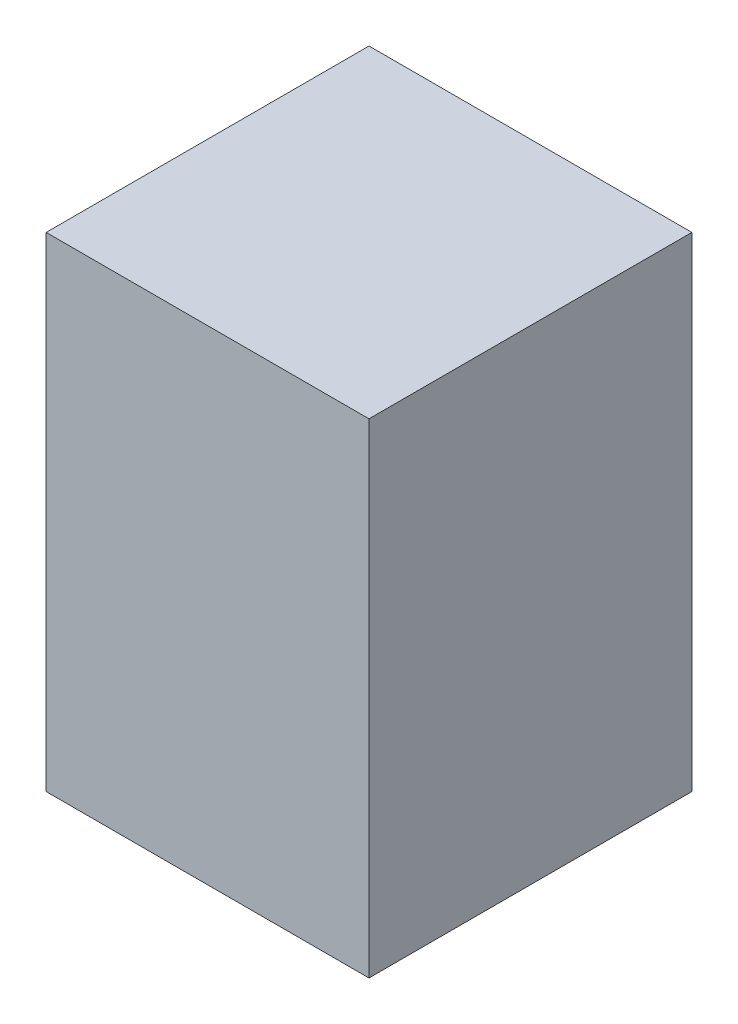
ISO-10303-21;
HEADER;
FILE_DESCRIPTION(('STEP AP214'),'2;1');
FILE_NAME('part.step','',(''),(''),'','','');
FILE_SCHEMA(('AUTOMOTIVE_DESIGN { 1 0 10303 214 1 1 1 1 }'));
ENDSEC;
DATA;
#1=APPLICATION_CONTEXT('core data for automotive mechanical design processes');
#2=APPLICATION_PROTOCOL_DEFINITION('international standard','automotive_design',2000,#1);
#3=PRODUCT_CONTEXT('',#1,'mechanical');
#4=PRODUCT('Part','Part','',(#3));
#5=PRODUCT_RELATED_PRODUCT_CATEGORY('part','',(#4));
#6=PRODUCT_DEFINITION_FORMATION('','',#4);
#7=PRODUCT_DEFINITION_CONTEXT('part definition',#1,'design');
#8=PRODUCT_DEFINITION('design','',#6,#7);
#9=PRODUCT_DEFINITION_SHAPE('','',#8);
#10=(LENGTH_UNIT() NAMED_UNIT(*) SI_UNIT(.MILLI.,.METRE.));
#11=(NAMED_UNIT(*) PLANE_ANGLE_UNIT() SI_UNIT($,.RADIAN.));
#12=(NAMED_UNIT(*) SI_UNIT($,.STERADIAN.) SOLID_ANGLE_UNIT());
#13=UNCERTAINTY_MEASURE_WITH_UNIT(LENGTH_MEASURE(1.E-05),#10,'distance_accuracy_value','');
#14=(GEOMETRIC_REPRESENTATION_CONTEXT(3) GLOBAL_UNCERTAINTY_ASSIGNED_CONTEXT((#13)) GLOBAL_UNIT_ASSIGNED_CONTEXT((#10,
#11,#12)) REPRESENTATION_CONTEXT('',''));
#15=CARTESIAN_POINT('',(0.,0.,0.));
#16=DIRECTION('',(0.,0.,1.));
#17=DIRECTION('',(1.,0.,0.));
#18=AXIS2_PLACEMENT_3D('',#15,#16,#17);
#19=CARTESIAN_POINT('',(-0.09999726000001,0.1499997,0.));
#20=DIRECTION('',(1.,0.,0.));
#21=DIRECTION('',(0.,0.,-1.));
#22=AXIS2_PLACEMENT_3D('',#19,#20,#21);
#23=PLANE('',#22);
#24=DIRECTION('',(0.,0.,1.));
#25=VECTOR('',#24,1.);
#26=CARTESIAN_POINT('',(-0.09999726000001,-0.1499997,0.));
#27=LINE('',#26,#25);
#28=CARTESIAN_POINT('',(-0.09999726000001,-0.1499997,0.));
#29=VERTEX_POINT('',#28);
#30=CARTESIAN_POINT('',(-0.09999726000001,-0.1499997,0.20000214));
#31=VERTEX_POINT('',#30);
#32=EDGE_CURVE('E20',#29,#31,#27,.T.);
#33=ORIENTED_EDGE('',*,*,#32,.T.);
#34=DIRECTION('',(0.,1.,0.));
#35=VECTOR('',#34,1.);
#36=CARTESIAN_POINT('',(-0.09999726000001,-0.1499997,0.20000214));
#37=LINE('',#36,#35);
#38=CARTESIAN_POINT('',(-0.09999726000001,0.1499997,0.20000214));
#39=VERTEX_POINT('',#38);
#40=EDGE_CURVE('E55',#31,#39,#37,.T.);
#41=ORIENTED_EDGE('',*,*,#40,.T.);
#42=DIRECTION('',(0.,0.,-1.));
#43=VECTOR('',#42,1.);
#44=CARTESIAN_POINT('',(-0.09999726000001,0.1499997,0.));
#45=LINE('',#44,#43);
#46=CARTESIAN_POINT('',(-0.09999726000001,0.1499997,0.));
#47=VERTEX_POINT('',#46);
#48=EDGE_CURVE('E76',#39,#47,#45,.T.);
#49=ORIENTED_EDGE('',*,*,#48,.T.);
#50=DIRECTION('',(0.,1.,0.));
#51=VECTOR('',#50,1.);
#52=CARTESIAN_POINT('',(-0.09999726000001,-0.1499997,0.));
#53=LINE('',#52,#51);
#54=EDGE_CURVE('E58',#29,#47,#53,.T.);
#55=ORIENTED_EDGE('',*,*,#54,.F.);
#56=EDGE_LOOP('',(#33,#41,#49,#55));
#57=FACE_BOUND('',#56,.T.);
#58=ADVANCED_FACE('F17',(#57),#23,.F.);
#59=CARTESIAN_POINT('',(-0.09999726000001,-0.1499997,0.));
#60=DIRECTION('',(0.,1.,0.));
#61=DIRECTION('',(0.,0.,1.));
#62=AXIS2_PLACEMENT_3D('',#59,#60,#61);
#63=PLANE('',#62);
#64=DIRECTION('',(0.,0.,1.));
#65=VECTOR('',#64,1.);
#66=CARTESIAN_POINT('',(0.09999979999999,-0.1499997,0.));
#67=LINE('',#66,#65);
#68=CARTESIAN_POINT('',(0.09999979999999,-0.1499997,0.));
#69=VERTEX_POINT('',#68);
#70=CARTESIAN_POINT('',(0.09999979999999,-0.1499997,0.20000214));
#71=VERTEX_POINT('',#70);
#72=EDGE_CURVE('E73',#69,#71,#67,.T.);
#73=ORIENTED_EDGE('',*,*,#72,.T.);
#74=DIRECTION('',(-1.,0.,0.));
#75=VECTOR('',#74,1.);
#76=CARTESIAN_POINT('',(0.09999979999999,-0.1499997,0.20000214));
#77=LINE('',#76,#75);
#78=EDGE_CURVE('E63',#71,#31,#77,.T.);
#79=ORIENTED_EDGE('',*,*,#78,.T.);
#80=ORIENTED_EDGE('',*,*,#32,.F.);
#81=DIRECTION('',(-1.,0.,0.));
#82=VECTOR('',#81,1.);
#83=CARTESIAN_POINT('',(0.09999979999999,-0.1499997,0.));
#84=LINE('',#83,#82);
#85=EDGE_CURVE('E78',#69,#29,#84,.T.);
#86=ORIENTED_EDGE('',*,*,#85,.F.);
#87=EDGE_LOOP('',(#73,#79,#80,#86));
#88=FACE_BOUND('',#87,.T.);
#89=ADVANCED_FACE('F72',(#88),#63,.F.);
#90=CARTESIAN_POINT('',(0.09999979999999,-0.1499997,0.20000214));
#91=DIRECTION('',(0.,0.,-1.));
#92=DIRECTION('',(-1.,0.,0.));
#93=AXIS2_PLACEMENT_3D('',#90,#91,#92);
#94=PLANE('',#93);
#95=DIRECTION('',(1.,0.,0.));
#96=VECTOR('',#95,1.);
#97=CARTESIAN_POINT('',(0.09999979999999,0.1499997,0.20000214));
#98=LINE('',#97,#96);
#99=CARTESIAN_POINT('',(0.09999979999999,0.1499997,0.20000214));
#100=VERTEX_POINT('',#99);
#101=EDGE_CURVE('E69',#100,#39,#98,.F.);
#102=ORIENTED_EDGE('',*,*,#101,.T.);
#103=ORIENTED_EDGE('',*,*,#40,.F.);
#104=ORIENTED_EDGE('',*,*,#78,.F.);
#105=DIRECTION('',(0.,1.,0.));
#106=VECTOR('',#105,1.);
#107=CARTESIAN_POINT('',(0.09999979999999,-0.1499997,0.20000214));
#108=LINE('',#107,#106);
#109=EDGE_CURVE('E83',#71,#100,#108,.T.);
#110=ORIENTED_EDGE('',*,*,#109,.T.);
#111=EDGE_LOOP('',(#102,#103,#104,#110));
#112=FACE_BOUND('',#111,.T.);
#113=ADVANCED_FACE('F66',(#112),#94,.F.);
#114=CARTESIAN_POINT('',(0.09999979999999,0.1499997,0.));
#115=DIRECTION('',(0.,-1.,0.));
#116=DIRECTION('',(0.,0.,-1.));
#117=AXIS2_PLACEMENT_3D('',#114,#115,#116);
#118=PLANE('',#117);
#119=ORIENTED_EDGE('',*,*,#48,.F.);
#120=ORIENTED_EDGE('',*,*,#101,.F.);
#121=DIRECTION('',(0.,0.,1.));
#122=VECTOR('',#121,1.);
#123=CARTESIAN_POINT('',(0.09999979999999,0.1499997,0.));
#124=LINE('',#123,#122);
#125=CARTESIAN_POINT('',(0.09999979999999,0.1499997,0.));
#126=VERTEX_POINT('',#125);
#127=EDGE_CURVE('E26',#100,#126,#124,.F.);
#128=ORIENTED_EDGE('',*,*,#127,.T.);
#129=DIRECTION('',(-1.,0.,0.));
#130=VECTOR('',#129,1.);
#131=CARTESIAN_POINT('',(0.09999979999999,0.1499997,0.));
#132=LINE('',#131,#130);
#133=EDGE_CURVE('E34',#47,#126,#132,.F.);
#134=ORIENTED_EDGE('',*,*,#133,.F.);
#135=EDGE_LOOP('',(#119,#120,#128,#134));
#136=FACE_BOUND('',#135,.T.);
#137=ADVANCED_FACE('F88',(#136),#118,.F.);
#138=CARTESIAN_POINT('',(0.09999979999999,-0.1499997,0.));
#139=DIRECTION('',(0.,0.,-1.));
#140=DIRECTION('',(-1.,0.,0.));
#141=AXIS2_PLACEMENT_3D('',#138,#139,#140);
#142=PLANE('',#141);
#143=ORIENTED_EDGE('',*,*,#133,.T.);
#144=DIRECTION('',(0.,1.,0.));
#145=VECTOR('',#144,1.);
#146=CARTESIAN_POINT('',(0.09999979999999,-0.1499997,0.));
#147=LINE('',#146,#145);
#148=EDGE_CURVE('E11',#126,#69,#147,.F.);
#149=ORIENTED_EDGE('',*,*,#148,.T.);
#150=ORIENTED_EDGE('',*,*,#85,.T.);
#151=ORIENTED_EDGE('',*,*,#54,.T.);
#152=EDGE_LOOP('',(#143,#149,#150,#151));
#153=FACE_BOUND('',#152,.T.);
#154=ADVANCED_FACE('F91',(#153),#142,.T.);
#155=CARTESIAN_POINT('',(0.09999979999999,-0.1499997,0.));
#156=DIRECTION('',(-1.,0.,0.));
#157=DIRECTION('',(0.,0.,1.));
#158=AXIS2_PLACEMENT_3D('',#155,#156,#157);
#159=PLANE('',#158);
#160=ORIENTED_EDGE('',*,*,#127,.F.);
#161=ORIENTED_EDGE('',*,*,#109,.F.);
#162=ORIENTED_EDGE('',*,*,#72,.F.);
#163=ORIENTED_EDGE('',*,*,#148,.F.);
#164=EDGE_LOOP('',(#160,#161,#162,#163));
#165=FACE_BOUND('',#164,.T.);
#166=ADVANCED_FACE('F90',(#165),#159,.F.);
#167=CLOSED_SHELL('',(#58,#89,#113,#137,#154,#166));
#168=MANIFOLD_SOLID_BREP('B1',#167);
#169=ADVANCED_BREP_SHAPE_REPRESENTATION('',(#18,#168),#14);
#170=SHAPE_DEFINITION_REPRESENTATION(#9,#169);
ENDSEC;
END-ISO-10303-21;
